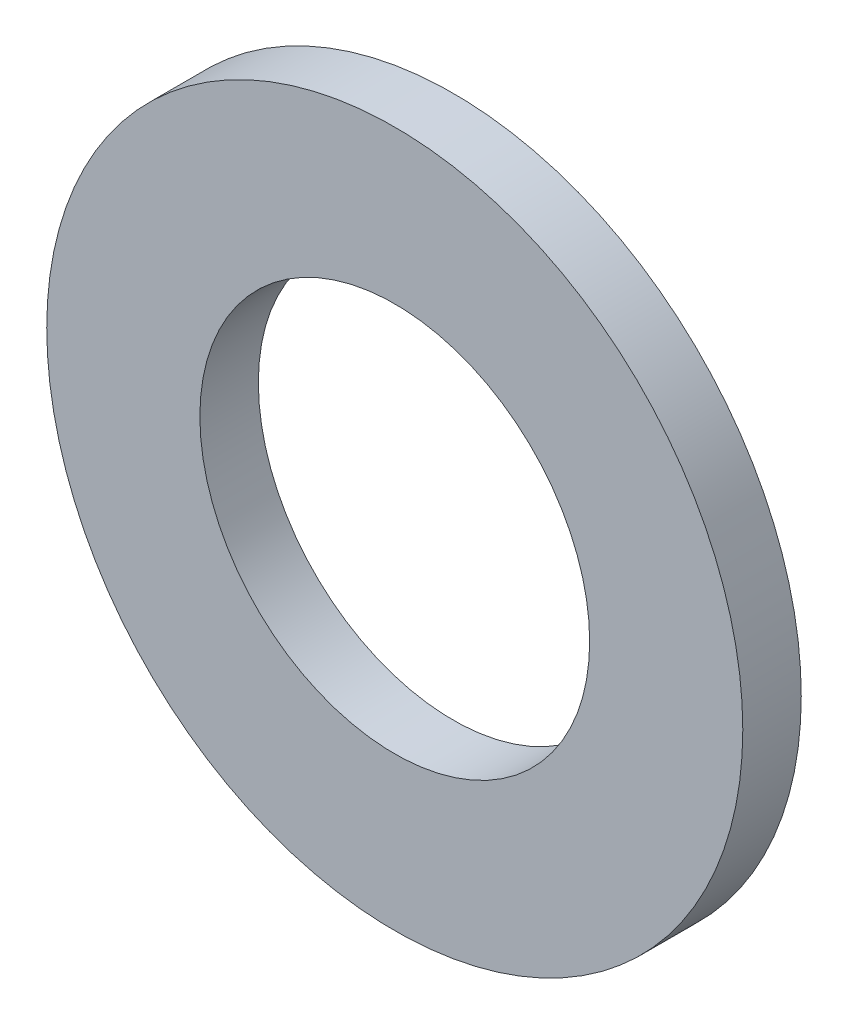
ISO-10303-21;
HEADER;
FILE_DESCRIPTION(('STEP AP214'),'2;1');
FILE_NAME('part.step','',(''),(''),'','','');
FILE_SCHEMA(('AUTOMOTIVE_DESIGN { 1 0 10303 214 1 1 1 1 }'));
ENDSEC;
DATA;
#1=APPLICATION_CONTEXT('core data for automotive mechanical design processes');
#2=APPLICATION_PROTOCOL_DEFINITION('international standard','automotive_design',2000,#1);
#3=PRODUCT_CONTEXT('',#1,'mechanical');
#4=PRODUCT('Part','Part','',(#3));
#5=PRODUCT_RELATED_PRODUCT_CATEGORY('part','',(#4));
#6=PRODUCT_DEFINITION_FORMATION('','',#4);
#7=PRODUCT_DEFINITION_CONTEXT('part definition',#1,'design');
#8=PRODUCT_DEFINITION('design','',#6,#7);
#9=PRODUCT_DEFINITION_SHAPE('','',#8);
#10=(LENGTH_UNIT() NAMED_UNIT(*) SI_UNIT(.MILLI.,.METRE.));
#11=(NAMED_UNIT(*) PLANE_ANGLE_UNIT() SI_UNIT($,.RADIAN.));
#12=(NAMED_UNIT(*) SI_UNIT($,.STERADIAN.) SOLID_ANGLE_UNIT());
#13=UNCERTAINTY_MEASURE_WITH_UNIT(LENGTH_MEASURE(1.E-05),#10,'distance_accuracy_value','');
#14=(GEOMETRIC_REPRESENTATION_CONTEXT(3) GLOBAL_UNCERTAINTY_ASSIGNED_CONTEXT((#13)) GLOBAL_UNIT_ASSIGNED_CONTEXT((#10,
#11,#12)) REPRESENTATION_CONTEXT('',''));
#15=CARTESIAN_POINT('',(0.,0.,0.));
#16=DIRECTION('',(0.,0.,1.));
#17=DIRECTION('',(1.,0.,0.));
#18=AXIS2_PLACEMENT_3D('',#15,#16,#17);
#19=CARTESIAN_POINT('',(0.,0.,2.1));
#20=DIRECTION('',(0.,0.,1.));
#21=DIRECTION('',(1.,0.,0.));
#22=AXIS2_PLACEMENT_3D('',#19,#20,#21);
#23=PLANE('',#22);
#24=CARTESIAN_POINT('',(0.,0.,2.1));
#25=DIRECTION('',(0.,0.,1.));
#26=DIRECTION('',(1.,0.,0.));
#27=AXIS2_PLACEMENT_3D('',#24,#25,#26);
#28=CIRCLE('',#27,12.5);
#29=CARTESIAN_POINT('',(12.5,0.,2.1));
#30=VERTEX_POINT('',#29);
#31=EDGE_CURVE('E10',#30,#30,#28,.T.);
#32=ORIENTED_EDGE('',*,*,#31,.T.);
#33=EDGE_LOOP('',(#32));
#34=FACE_BOUND('',#33,.T.);
#35=CARTESIAN_POINT('',(0.,0.,2.1));
#36=DIRECTION('',(0.,0.,1.));
#37=DIRECTION('',(1.,0.,0.));
#38=AXIS2_PLACEMENT_3D('',#35,#36,#37);
#39=CIRCLE('',#38,7.);
#40=CARTESIAN_POINT('',(7.,0.,2.1));
#41=VERTEX_POINT('',#40);
#42=EDGE_CURVE('E50',#41,#41,#39,.T.);
#43=ORIENTED_EDGE('',*,*,#42,.F.);
#44=EDGE_LOOP('',(#43));
#45=FACE_BOUND('',#44,.T.);
#46=ADVANCED_FACE('F37',(#34,#45),#23,.T.);
#47=CARTESIAN_POINT('',(0.,0.,0.));
#48=DIRECTION('',(0.,0.,1.));
#49=DIRECTION('',(1.,0.,0.));
#50=AXIS2_PLACEMENT_3D('',#47,#48,#49);
#51=PLANE('',#50);
#52=CARTESIAN_POINT('',(0.,0.,0.));
#53=DIRECTION('',(0.,0.,1.));
#54=DIRECTION('',(1.,0.,0.));
#55=AXIS2_PLACEMENT_3D('',#52,#53,#54);
#56=CIRCLE('',#55,12.5);
#57=CARTESIAN_POINT('',(12.5,0.,0.));
#58=VERTEX_POINT('',#57);
#59=EDGE_CURVE('E41',#58,#58,#56,.T.);
#60=ORIENTED_EDGE('',*,*,#59,.F.);
#61=EDGE_LOOP('',(#60));
#62=FACE_BOUND('',#61,.T.);
#63=CARTESIAN_POINT('',(0.,0.,0.));
#64=DIRECTION('',(0.,0.,1.));
#65=DIRECTION('',(1.,0.,0.));
#66=AXIS2_PLACEMENT_3D('',#63,#64,#65);
#67=CIRCLE('',#66,7.);
#68=CARTESIAN_POINT('',(7.,0.,0.));
#69=VERTEX_POINT('',#68);
#70=EDGE_CURVE('E52',#69,#69,#67,.T.);
#71=ORIENTED_EDGE('',*,*,#70,.T.);
#72=EDGE_LOOP('',(#71));
#73=FACE_BOUND('',#72,.T.);
#74=ADVANCED_FACE('F64',(#62,#73),#51,.F.);
#75=CARTESIAN_POINT('',(0.,0.,2.1));
#76=DIRECTION('',(0.,0.,-1.));
#77=DIRECTION('',(-1.,0.,0.));
#78=AXIS2_PLACEMENT_3D('',#75,#76,#77);
#79=CYLINDRICAL_SURFACE('',#78,12.5);
#80=ORIENTED_EDGE('',*,*,#31,.F.);
#81=EDGE_LOOP('',(#80));
#82=FACE_BOUND('',#81,.T.);
#83=ORIENTED_EDGE('',*,*,#59,.T.);
#84=EDGE_LOOP('',(#83));
#85=FACE_BOUND('',#84,.T.);
#86=ADVANCED_FACE('F39',(#82,#85),#79,.T.);
#87=CARTESIAN_POINT('',(0.,0.,2.1));
#88=DIRECTION('',(0.,0.,-1.));
#89=DIRECTION('',(-1.,0.,0.));
#90=AXIS2_PLACEMENT_3D('',#87,#88,#89);
#91=CYLINDRICAL_SURFACE('',#90,7.);
#92=ORIENTED_EDGE('',*,*,#42,.T.);
#93=EDGE_LOOP('',(#92));
#94=FACE_BOUND('',#93,.T.);
#95=ORIENTED_EDGE('',*,*,#70,.F.);
#96=EDGE_LOOP('',(#95));
#97=FACE_BOUND('',#96,.T.);
#98=ADVANCED_FACE('F60',(#94,#97),#91,.F.);
#99=CLOSED_SHELL('',(#46,#74,#86,#98));
#100=MANIFOLD_SOLID_BREP('B2',#99);
#101=ADVANCED_BREP_SHAPE_REPRESENTATION('',(#18,#100),#14);
#102=SHAPE_DEFINITION_REPRESENTATION(#9,#101);
ENDSEC;
END-ISO-10303-21;
